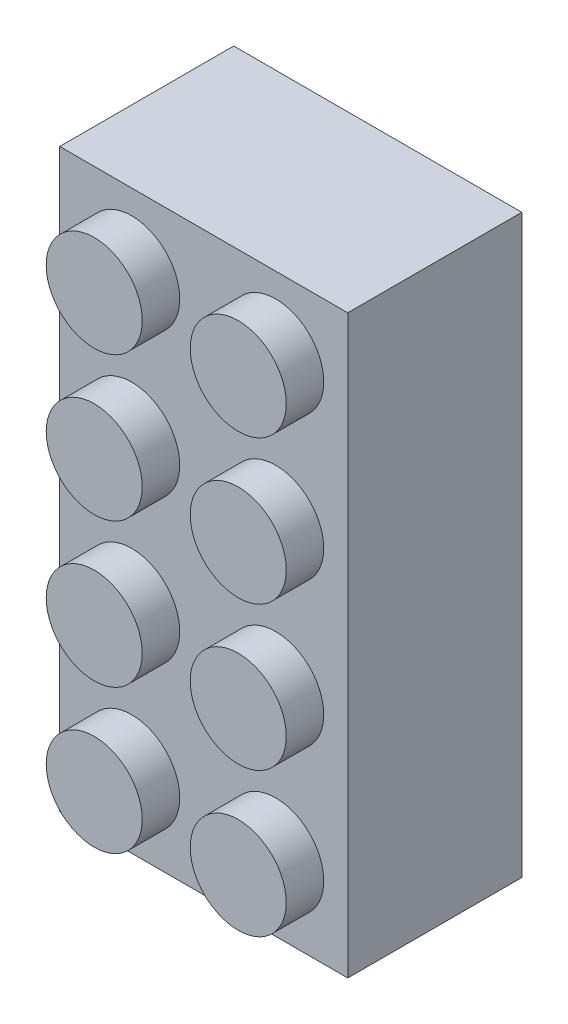
ISO-10303-21;
HEADER;
FILE_DESCRIPTION(('STEP AP214'),'2;1');
FILE_NAME('part.step','',(''),(''),'','','');
FILE_SCHEMA(('AUTOMOTIVE_DESIGN { 1 0 10303 214 1 1 1 1 }'));
ENDSEC;
DATA;
#1=APPLICATION_CONTEXT('core data for automotive mechanical design processes');
#2=APPLICATION_PROTOCOL_DEFINITION('international standard','automotive_design',2000,#1);
#3=PRODUCT_CONTEXT('',#1,'mechanical');
#4=PRODUCT('Part','Part','',(#3));
#5=PRODUCT_RELATED_PRODUCT_CATEGORY('part','',(#4));
#6=PRODUCT_DEFINITION_FORMATION('','',#4);
#7=PRODUCT_DEFINITION_CONTEXT('part definition',#1,'design');
#8=PRODUCT_DEFINITION('design','',#6,#7);
#9=PRODUCT_DEFINITION_SHAPE('','',#8);
#10=(LENGTH_UNIT() NAMED_UNIT(*) SI_UNIT(.MILLI.,.METRE.));
#11=(NAMED_UNIT(*) PLANE_ANGLE_UNIT() SI_UNIT($,.RADIAN.));
#12=(NAMED_UNIT(*) SI_UNIT($,.STERADIAN.) SOLID_ANGLE_UNIT());
#13=UNCERTAINTY_MEASURE_WITH_UNIT(LENGTH_MEASURE(1.E-05),#10,'distance_accuracy_value','');
#14=(GEOMETRIC_REPRESENTATION_CONTEXT(3) GLOBAL_UNCERTAINTY_ASSIGNED_CONTEXT((#13)) GLOBAL_UNIT_ASSIGNED_CONTEXT((#10,
#11,#12)) REPRESENTATION_CONTEXT('',''));
#15=CARTESIAN_POINT('',(0.,0.,0.));
#16=DIRECTION('',(0.,0.,1.));
#17=DIRECTION('',(1.,0.,0.));
#18=AXIS2_PLACEMENT_3D('',#15,#16,#17);
#19=CARTESIAN_POINT('',(48.,144.,0.));
#20=DIRECTION('',(0.,0.,-1.));
#21=DIRECTION('',(-1.,0.,0.));
#22=AXIS2_PLACEMENT_3D('',#19,#20,#21);
#23=PLANE('',#22);
#24=DIRECTION('',(0.,-1.,0.));
#25=VECTOR('',#24,1.);
#26=CARTESIAN_POINT('',(7.99999999999999,104.,0.));
#27=LINE('',#26,#25);
#28=CARTESIAN_POINT('',(7.99999999999999,184.,0.));
#29=VERTEX_POINT('',#28);
#30=CARTESIAN_POINT('',(8.00000000000001,8.00000000000001,0.));
#31=VERTEX_POINT('',#30);
#32=EDGE_CURVE('E59',#29,#31,#27,.T.);
#33=ORIENTED_EDGE('',*,*,#32,.T.);
#34=DIRECTION('',(1.,0.,0.));
#35=VECTOR('',#34,1.);
#36=CARTESIAN_POINT('',(88.,8.00000000000001,0.));
#37=LINE('',#36,#35);
#38=CARTESIAN_POINT('',(88.,8.00000000000001,0.));
#39=VERTEX_POINT('',#38);
#40=EDGE_CURVE('E141',#31,#39,#37,.T.);
#41=ORIENTED_EDGE('',*,*,#40,.T.);
#42=DIRECTION('',(0.,1.,0.));
#43=VECTOR('',#42,1.);
#44=CARTESIAN_POINT('',(88.,184.,0.));
#45=LINE('',#44,#43);
#46=CARTESIAN_POINT('',(88.,184.,0.));
#47=VERTEX_POINT('',#46);
#48=EDGE_CURVE('E235',#39,#47,#45,.T.);
#49=ORIENTED_EDGE('',*,*,#48,.T.);
#50=DIRECTION('',(-1.,0.,0.));
#51=VECTOR('',#50,1.);
#52=CARTESIAN_POINT('',(7.99999999999999,184.,0.));
#53=LINE('',#52,#51);
#54=EDGE_CURVE('E224',#47,#29,#53,.T.);
#55=ORIENTED_EDGE('',*,*,#54,.T.);
#56=EDGE_LOOP('',(#33,#41,#49,#55));
#57=FACE_BOUND('',#56,.T.);
#58=DIRECTION('',(0.,-1.,0.));
#59=VECTOR('',#58,1.);
#60=CARTESIAN_POINT('',(0.,96.,0.));
#61=LINE('',#60,#59);
#62=CARTESIAN_POINT('',(0.,192.,0.));
#63=VERTEX_POINT('',#62);
#64=CARTESIAN_POINT('',(0.,0.,0.));
#65=VERTEX_POINT('',#64);
#66=EDGE_CURVE('E129',#63,#65,#61,.T.);
#67=ORIENTED_EDGE('',*,*,#66,.F.);
#68=DIRECTION('',(-1.,0.,0.));
#69=VECTOR('',#68,1.);
#70=CARTESIAN_POINT('',(0.,192.,0.));
#71=LINE('',#70,#69);
#72=CARTESIAN_POINT('',(96.,192.,0.));
#73=VERTEX_POINT('',#72);
#74=EDGE_CURVE('E67',#73,#63,#71,.T.);
#75=ORIENTED_EDGE('',*,*,#74,.F.);
#76=DIRECTION('',(0.,1.,0.));
#77=VECTOR('',#76,1.);
#78=CARTESIAN_POINT('',(96.,192.,0.));
#79=LINE('',#78,#77);
#80=CARTESIAN_POINT('',(96.,0.,0.));
#81=VERTEX_POINT('',#80);
#82=EDGE_CURVE('E249',#81,#73,#79,.T.);
#83=ORIENTED_EDGE('',*,*,#82,.F.);
#84=DIRECTION('',(1.,0.,0.));
#85=VECTOR('',#84,1.);
#86=CARTESIAN_POINT('',(96.,0.,0.));
#87=LINE('',#86,#85);
#88=EDGE_CURVE('E164',#65,#81,#87,.T.);
#89=ORIENTED_EDGE('',*,*,#88,.F.);
#90=EDGE_LOOP('',(#67,#75,#83,#89));
#91=FACE_BOUND('',#90,.T.);
#92=ADVANCED_FACE('F43',(#57,#91),#23,.T.);
#93=CARTESIAN_POINT('',(0.,96.,48.));
#94=DIRECTION('',(1.,0.,0.));
#95=DIRECTION('',(0.,1.,0.));
#96=AXIS2_PLACEMENT_3D('',#93,#94,#95);
#97=PLANE('',#96);
#98=ORIENTED_EDGE('',*,*,#66,.T.);
#99=DIRECTION('',(0.,0.,-1.));
#100=VECTOR('',#99,1.);
#101=CARTESIAN_POINT('',(0.,0.,48.));
#102=LINE('',#101,#100);
#103=CARTESIAN_POINT('',(0.,0.,58.));
#104=VERTEX_POINT('',#103);
#105=EDGE_CURVE('E126',#104,#65,#102,.T.);
#106=ORIENTED_EDGE('',*,*,#105,.F.);
#107=DIRECTION('',(0.,1.,0.));
#108=VECTOR('',#107,1.);
#109=CARTESIAN_POINT('',(0.,192.,58.));
#110=LINE('',#109,#108);
#111=CARTESIAN_POINT('',(0.,192.,58.));
#112=VERTEX_POINT('',#111);
#113=EDGE_CURVE('E112',#104,#112,#110,.T.);
#114=ORIENTED_EDGE('',*,*,#113,.T.);
#115=DIRECTION('',(0.,0.,-1.));
#116=VECTOR('',#115,1.);
#117=CARTESIAN_POINT('',(0.,192.,48.));
#118=LINE('',#117,#116);
#119=EDGE_CURVE('E254',#112,#63,#118,.T.);
#120=ORIENTED_EDGE('',*,*,#119,.T.);
#121=EDGE_LOOP('',(#98,#106,#114,#120));
#122=FACE_BOUND('',#121,.T.);
#123=ADVANCED_FACE('F127',(#122),#97,.F.);
#124=CARTESIAN_POINT('',(96.,192.,48.));
#125=DIRECTION('',(-1.,0.,0.));
#126=DIRECTION('',(0.,-1.,0.));
#127=AXIS2_PLACEMENT_3D('',#124,#125,#126);
#128=PLANE('',#127);
#129=ORIENTED_EDGE('',*,*,#82,.T.);
#130=DIRECTION('',(0.,0.,-1.));
#131=VECTOR('',#130,1.);
#132=CARTESIAN_POINT('',(96.,192.,48.));
#133=LINE('',#132,#131);
#134=CARTESIAN_POINT('',(96.,192.,58.));
#135=VERTEX_POINT('',#134);
#136=EDGE_CURVE('E257',#135,#73,#133,.T.);
#137=ORIENTED_EDGE('',*,*,#136,.F.);
#138=DIRECTION('',(0.,-1.,0.));
#139=VECTOR('',#138,1.);
#140=CARTESIAN_POINT('',(96.,192.,58.));
#141=LINE('',#140,#139);
#142=CARTESIAN_POINT('',(96.,0.,58.));
#143=VERTEX_POINT('',#142);
#144=EDGE_CURVE('E123',#135,#143,#141,.T.);
#145=ORIENTED_EDGE('',*,*,#144,.T.);
#146=DIRECTION('',(0.,0.,-1.));
#147=VECTOR('',#146,1.);
#148=CARTESIAN_POINT('',(96.,0.,48.));
#149=LINE('',#148,#147);
#150=EDGE_CURVE('E135',#143,#81,#149,.T.);
#151=ORIENTED_EDGE('',*,*,#150,.T.);
#152=EDGE_LOOP('',(#129,#137,#145,#151));
#153=FACE_BOUND('',#152,.T.);
#154=ADVANCED_FACE('F317',(#153),#128,.F.);
#155=CARTESIAN_POINT('',(0.,192.,48.));
#156=DIRECTION('',(0.,-1.,0.));
#157=DIRECTION('',(1.,0.,0.));
#158=AXIS2_PLACEMENT_3D('',#155,#156,#157);
#159=PLANE('',#158);
#160=ORIENTED_EDGE('',*,*,#74,.T.);
#161=ORIENTED_EDGE('',*,*,#119,.F.);
#162=DIRECTION('',(1.,0.,0.));
#163=VECTOR('',#162,1.);
#164=CARTESIAN_POINT('',(0.,192.,58.));
#165=LINE('',#164,#163);
#166=EDGE_CURVE('E120',#112,#135,#165,.T.);
#167=ORIENTED_EDGE('',*,*,#166,.T.);
#168=ORIENTED_EDGE('',*,*,#136,.T.);
#169=EDGE_LOOP('',(#160,#161,#167,#168));
#170=FACE_BOUND('',#169,.T.);
#171=ADVANCED_FACE('F324',(#170),#159,.F.);
#172=CARTESIAN_POINT('',(7.99999999999999,104.,48.));
#173=DIRECTION('',(1.,0.,0.));
#174=DIRECTION('',(0.,0.,-1.));
#175=AXIS2_PLACEMENT_3D('',#172,#173,#174);
#176=PLANE('',#175);
#177=ORIENTED_EDGE('',*,*,#32,.F.);
#178=DIRECTION('',(0.,0.,-1.));
#179=VECTOR('',#178,1.);
#180=CARTESIAN_POINT('',(7.99999999999999,184.,48.));
#181=LINE('',#180,#179);
#182=CARTESIAN_POINT('',(7.99999999999999,184.,48.));
#183=VERTEX_POINT('',#182);
#184=EDGE_CURVE('E232',#183,#29,#181,.T.);
#185=ORIENTED_EDGE('',*,*,#184,.F.);
#186=DIRECTION('',(0.,-1.,0.));
#187=VECTOR('',#186,1.);
#188=CARTESIAN_POINT('',(7.99999999999999,104.,48.));
#189=LINE('',#188,#187);
#190=CARTESIAN_POINT('',(8.00000000000001,8.00000000000001,48.));
#191=VERTEX_POINT('',#190);
#192=EDGE_CURVE('E220',#183,#191,#189,.T.);
#193=ORIENTED_EDGE('',*,*,#192,.T.);
#194=DIRECTION('',(0.,0.,-1.));
#195=VECTOR('',#194,1.);
#196=CARTESIAN_POINT('',(8.00000000000001,8.00000000000001,48.));
#197=LINE('',#196,#195);
#198=EDGE_CURVE('E161',#191,#31,#197,.T.);
#199=ORIENTED_EDGE('',*,*,#198,.T.);
#200=EDGE_LOOP('',(#177,#185,#193,#199));
#201=FACE_BOUND('',#200,.T.);
#202=ADVANCED_FACE('F322',(#201),#176,.T.);
#203=CARTESIAN_POINT('',(88.,184.,48.));
#204=DIRECTION('',(-1.,0.,0.));
#205=DIRECTION('',(0.,0.,1.));
#206=AXIS2_PLACEMENT_3D('',#203,#204,#205);
#207=PLANE('',#206);
#208=ORIENTED_EDGE('',*,*,#48,.F.);
#209=DIRECTION('',(0.,0.,-1.));
#210=VECTOR('',#209,1.);
#211=CARTESIAN_POINT('',(88.,8.00000000000001,48.));
#212=LINE('',#211,#210);
#213=CARTESIAN_POINT('',(88.,8.00000000000001,48.));
#214=VERTEX_POINT('',#213);
#215=EDGE_CURVE('E156',#214,#39,#212,.T.);
#216=ORIENTED_EDGE('',*,*,#215,.F.);
#217=DIRECTION('',(0.,1.,0.));
#218=VECTOR('',#217,1.);
#219=CARTESIAN_POINT('',(88.,184.,48.));
#220=LINE('',#219,#218);
#221=CARTESIAN_POINT('',(88.,184.,48.));
#222=VERTEX_POINT('',#221);
#223=EDGE_CURVE('E223',#214,#222,#220,.T.);
#224=ORIENTED_EDGE('',*,*,#223,.T.);
#225=DIRECTION('',(0.,0.,-1.));
#226=VECTOR('',#225,1.);
#227=CARTESIAN_POINT('',(88.,184.,48.));
#228=LINE('',#227,#226);
#229=EDGE_CURVE('E244',#222,#47,#228,.T.);
#230=ORIENTED_EDGE('',*,*,#229,.T.);
#231=EDGE_LOOP('',(#208,#216,#224,#230));
#232=FACE_BOUND('',#231,.T.);
#233=ADVANCED_FACE('F597',(#232),#207,.T.);
#234=CARTESIAN_POINT('',(7.99999999999999,184.,48.));
#235=DIRECTION('',(0.,-1.,0.));
#236=DIRECTION('',(0.,0.,-1.));
#237=AXIS2_PLACEMENT_3D('',#234,#235,#236);
#238=PLANE('',#237);
#239=ORIENTED_EDGE('',*,*,#54,.F.);
#240=ORIENTED_EDGE('',*,*,#229,.F.);
#241=DIRECTION('',(-1.,0.,0.));
#242=VECTOR('',#241,1.);
#243=CARTESIAN_POINT('',(7.99999999999999,184.,48.));
#244=LINE('',#243,#242);
#245=EDGE_CURVE('E228',#222,#183,#244,.T.);
#246=ORIENTED_EDGE('',*,*,#245,.T.);
#247=ORIENTED_EDGE('',*,*,#184,.T.);
#248=EDGE_LOOP('',(#239,#240,#246,#247));
#249=FACE_BOUND('',#248,.T.);
#250=ADVANCED_FACE('F309',(#249),#238,.T.);
#251=CARTESIAN_POINT('',(48.,144.,48.));
#252=DIRECTION('',(0.,0.,1.));
#253=DIRECTION('',(1.,0.,0.));
#254=AXIS2_PLACEMENT_3D('',#251,#252,#253);
#255=PLANE('',#254);
#256=CARTESIAN_POINT('',(48.,96.,48.));
#257=DIRECTION('',(0.,0.,1.));
#258=DIRECTION('',(1.,0.,0.));
#259=AXIS2_PLACEMENT_3D('',#256,#257,#258);
#260=CIRCLE('',#259,22.6994558492443);
#261=CARTESIAN_POINT('',(70.6994558492443,96.,48.));
#262=VERTEX_POINT('',#261);
#263=EDGE_CURVE('E12',#262,#262,#260,.T.);
#264=ORIENTED_EDGE('',*,*,#263,.T.);
#265=EDGE_LOOP('',(#264));
#266=FACE_BOUND('',#265,.T.);
#267=CARTESIAN_POINT('',(48.,144.,48.));
#268=DIRECTION('',(0.,0.,1.));
#269=DIRECTION('',(1.,0.,0.));
#270=AXIS2_PLACEMENT_3D('',#267,#268,#269);
#271=CIRCLE('',#270,22.6994558492444);
#272=CARTESIAN_POINT('',(70.6994558492443,144.,48.));
#273=VERTEX_POINT('',#272);
#274=EDGE_CURVE('E280',#273,#273,#271,.T.);
#275=ORIENTED_EDGE('',*,*,#274,.T.);
#276=EDGE_LOOP('',(#275));
#277=FACE_BOUND('',#276,.T.);
#278=ORIENTED_EDGE('',*,*,#192,.F.);
#279=ORIENTED_EDGE('',*,*,#245,.F.);
#280=ORIENTED_EDGE('',*,*,#223,.F.);
#281=DIRECTION('',(1.,0.,0.));
#282=VECTOR('',#281,1.);
#283=CARTESIAN_POINT('',(88.,8.00000000000001,48.));
#284=LINE('',#283,#282);
#285=EDGE_CURVE('E147',#191,#214,#284,.T.);
#286=ORIENTED_EDGE('',*,*,#285,.F.);
#287=EDGE_LOOP('',(#278,#279,#280,#286));
#288=FACE_BOUND('',#287,.T.);
#289=CARTESIAN_POINT('',(48.,48.,48.));
#290=DIRECTION('',(0.,0.,1.));
#291=DIRECTION('',(1.,0.,0.));
#292=AXIS2_PLACEMENT_3D('',#289,#290,#291);
#293=CIRCLE('',#292,22.6994558492444);
#294=CARTESIAN_POINT('',(70.6994558492444,48.,48.));
#295=VERTEX_POINT('',#294);
#296=EDGE_CURVE('E188',#295,#295,#293,.T.);
#297=ORIENTED_EDGE('',*,*,#296,.T.);
#298=EDGE_LOOP('',(#297));
#299=FACE_BOUND('',#298,.T.);
#300=ADVANCED_FACE('F294',(#266,#277,#288,#299),#255,.F.);
#301=CARTESIAN_POINT('',(48.,144.,58.));
#302=DIRECTION('',(0.,0.,-1.));
#303=DIRECTION('',(-1.,0.,0.));
#304=AXIS2_PLACEMENT_3D('',#301,#302,#303);
#305=PLANE('',#304);
#306=CARTESIAN_POINT('',(24.,120.,58.));
#307=DIRECTION('',(0.,0.,-1.));
#308=DIRECTION('',(-1.,0.,0.));
#309=AXIS2_PLACEMENT_3D('',#306,#307,#308);
#310=CIRCLE('',#309,16.);
#311=CARTESIAN_POINT('',(7.99999999999997,120.,58.));
#312=VERTEX_POINT('',#311);
#313=EDGE_CURVE('E272',#312,#312,#310,.F.);
#314=ORIENTED_EDGE('',*,*,#313,.F.);
#315=EDGE_LOOP('',(#314));
#316=FACE_BOUND('',#315,.T.);
#317=CARTESIAN_POINT('',(72.,120.,58.));
#318=DIRECTION('',(0.,0.,-1.));
#319=DIRECTION('',(-1.,0.,0.));
#320=AXIS2_PLACEMENT_3D('',#317,#318,#319);
#321=CIRCLE('',#320,16.);
#322=CARTESIAN_POINT('',(56.,120.,58.));
#323=VERTEX_POINT('',#322);
#324=EDGE_CURVE('E268',#323,#323,#321,.F.);
#325=ORIENTED_EDGE('',*,*,#324,.F.);
#326=EDGE_LOOP('',(#325));
#327=FACE_BOUND('',#326,.T.);
#328=CARTESIAN_POINT('',(72.,168.,58.));
#329=DIRECTION('',(0.,0.,-1.));
#330=DIRECTION('',(-1.,0.,0.));
#331=AXIS2_PLACEMENT_3D('',#328,#329,#330);
#332=CIRCLE('',#331,16.);
#333=CARTESIAN_POINT('',(56.,168.,58.));
#334=VERTEX_POINT('',#333);
#335=EDGE_CURVE('E264',#334,#334,#332,.F.);
#336=ORIENTED_EDGE('',*,*,#335,.F.);
#337=EDGE_LOOP('',(#336));
#338=FACE_BOUND('',#337,.T.);
#339=CARTESIAN_POINT('',(24.,168.,58.));
#340=DIRECTION('',(0.,0.,-1.));
#341=DIRECTION('',(-1.,0.,0.));
#342=AXIS2_PLACEMENT_3D('',#339,#340,#341);
#343=CIRCLE('',#342,16.);
#344=CARTESIAN_POINT('',(7.99999999999997,168.,58.));
#345=VERTEX_POINT('',#344);
#346=EDGE_CURVE('E260',#345,#345,#343,.F.);
#347=ORIENTED_EDGE('',*,*,#346,.F.);
#348=EDGE_LOOP('',(#347));
#349=FACE_BOUND('',#348,.T.);
#350=ORIENTED_EDGE('',*,*,#113,.F.);
#351=DIRECTION('',(-1.,0.,0.));
#352=VECTOR('',#351,1.);
#353=CARTESIAN_POINT('',(0.,0.,58.));
#354=LINE('',#353,#352);
#355=EDGE_CURVE('E118',#143,#104,#354,.T.);
#356=ORIENTED_EDGE('',*,*,#355,.F.);
#357=ORIENTED_EDGE('',*,*,#144,.F.);
#358=ORIENTED_EDGE('',*,*,#166,.F.);
#359=EDGE_LOOP('',(#350,#356,#357,#358));
#360=FACE_BOUND('',#359,.T.);
#361=CARTESIAN_POINT('',(24.,24.,58.));
#362=DIRECTION('',(0.,0.,-1.));
#363=DIRECTION('',(-1.,0.,0.));
#364=AXIS2_PLACEMENT_3D('',#361,#362,#363);
#365=CIRCLE('',#364,16.);
#366=CARTESIAN_POINT('',(7.99999999999999,24.,58.));
#367=VERTEX_POINT('',#366);
#368=EDGE_CURVE('E180',#367,#367,#365,.F.);
#369=ORIENTED_EDGE('',*,*,#368,.F.);
#370=EDGE_LOOP('',(#369));
#371=FACE_BOUND('',#370,.T.);
#372=CARTESIAN_POINT('',(72.,24.,58.));
#373=DIRECTION('',(0.,0.,-1.));
#374=DIRECTION('',(-1.,0.,0.));
#375=AXIS2_PLACEMENT_3D('',#372,#373,#374);
#376=CIRCLE('',#375,16.);
#377=CARTESIAN_POINT('',(56.,24.,58.));
#378=VERTEX_POINT('',#377);
#379=EDGE_CURVE('E176',#378,#378,#376,.F.);
#380=ORIENTED_EDGE('',*,*,#379,.F.);
#381=EDGE_LOOP('',(#380));
#382=FACE_BOUND('',#381,.T.);
#383=CARTESIAN_POINT('',(72.,72.,58.));
#384=DIRECTION('',(0.,0.,-1.));
#385=DIRECTION('',(-1.,0.,0.));
#386=AXIS2_PLACEMENT_3D('',#383,#384,#385);
#387=CIRCLE('',#386,16.);
#388=CARTESIAN_POINT('',(56.,72.,58.));
#389=VERTEX_POINT('',#388);
#390=EDGE_CURVE('E172',#389,#389,#387,.F.);
#391=ORIENTED_EDGE('',*,*,#390,.F.);
#392=EDGE_LOOP('',(#391));
#393=FACE_BOUND('',#392,.T.);
#394=CARTESIAN_POINT('',(24.,72.,58.));
#395=DIRECTION('',(0.,0.,-1.));
#396=DIRECTION('',(-1.,0.,0.));
#397=AXIS2_PLACEMENT_3D('',#394,#395,#396);
#398=CIRCLE('',#397,16.);
#399=CARTESIAN_POINT('',(7.99999999999999,72.,58.));
#400=VERTEX_POINT('',#399);
#401=EDGE_CURVE('E134',#400,#400,#398,.F.);
#402=ORIENTED_EDGE('',*,*,#401,.F.);
#403=EDGE_LOOP('',(#402));
#404=FACE_BOUND('',#403,.T.);
#405=ADVANCED_FACE('F114',(#316,#327,#338,#349,#360,#371,#382,#393,#404),#305,.F.);
#406=CARTESIAN_POINT('',(24.,168.,70.5));
#407=DIRECTION('',(0.,0.,-1.));
#408=DIRECTION('',(-1.,0.,0.));
#409=AXIS2_PLACEMENT_3D('',#406,#407,#408);
#410=CYLINDRICAL_SURFACE('',#409,16.);
#411=CARTESIAN_POINT('',(24.,168.,70.5));
#412=DIRECTION('',(0.,0.,1.));
#413=DIRECTION('',(1.,0.,0.));
#414=AXIS2_PLACEMENT_3D('',#411,#412,#413);
#415=CIRCLE('',#414,16.);
#416=CARTESIAN_POINT('',(40.,168.,70.5));
#417=VERTEX_POINT('',#416);
#418=EDGE_CURVE('E212',#417,#417,#415,.T.);
#419=ORIENTED_EDGE('',*,*,#418,.F.);
#420=EDGE_LOOP('',(#419));
#421=FACE_BOUND('',#420,.T.);
#422=ORIENTED_EDGE('',*,*,#346,.T.);
#423=EDGE_LOOP('',(#422));
#424=FACE_BOUND('',#423,.T.);
#425=ADVANCED_FACE('F380',(#421,#424),#410,.T.);
#426=CARTESIAN_POINT('',(24.,168.,70.5));
#427=DIRECTION('',(0.,0.,1.));
#428=DIRECTION('',(1.,0.,0.));
#429=AXIS2_PLACEMENT_3D('',#426,#427,#428);
#430=PLANE('',#429);
#431=ORIENTED_EDGE('',*,*,#418,.T.);
#432=EDGE_LOOP('',(#431));
#433=FACE_BOUND('',#432,.T.);
#434=ADVANCED_FACE('F376',(#433),#430,.T.);
#435=CARTESIAN_POINT('',(72.,168.,70.5));
#436=DIRECTION('',(0.,0.,-1.));
#437=DIRECTION('',(-1.,0.,0.));
#438=AXIS2_PLACEMENT_3D('',#435,#436,#437);
#439=CYLINDRICAL_SURFACE('',#438,16.);
#440=CARTESIAN_POINT('',(72.,168.,70.5));
#441=DIRECTION('',(0.,0.,1.));
#442=DIRECTION('',(1.,0.,0.));
#443=AXIS2_PLACEMENT_3D('',#440,#441,#442);
#444=CIRCLE('',#443,16.);
#445=CARTESIAN_POINT('',(88.,168.,70.5));
#446=VERTEX_POINT('',#445);
#447=EDGE_CURVE('E208',#446,#446,#444,.T.);
#448=ORIENTED_EDGE('',*,*,#447,.F.);
#449=EDGE_LOOP('',(#448));
#450=FACE_BOUND('',#449,.T.);
#451=ORIENTED_EDGE('',*,*,#335,.T.);
#452=EDGE_LOOP('',(#451));
#453=FACE_BOUND('',#452,.T.);
#454=ADVANCED_FACE('F372',(#450,#453),#439,.T.);
#455=CARTESIAN_POINT('',(72.,168.,70.5));
#456=DIRECTION('',(0.,0.,1.));
#457=DIRECTION('',(1.,0.,0.));
#458=AXIS2_PLACEMENT_3D('',#455,#456,#457);
#459=PLANE('',#458);
#460=ORIENTED_EDGE('',*,*,#447,.T.);
#461=EDGE_LOOP('',(#460));
#462=FACE_BOUND('',#461,.T.);
#463=ADVANCED_FACE('F368',(#462),#459,.T.);
#464=CARTESIAN_POINT('',(72.,120.,70.5));
#465=DIRECTION('',(0.,0.,-1.));
#466=DIRECTION('',(-1.,0.,0.));
#467=AXIS2_PLACEMENT_3D('',#464,#465,#466);
#468=CYLINDRICAL_SURFACE('',#467,16.);
#469=CARTESIAN_POINT('',(72.,120.,70.5));
#470=DIRECTION('',(0.,0.,1.));
#471=DIRECTION('',(1.,0.,0.));
#472=AXIS2_PLACEMENT_3D('',#469,#470,#471);
#473=CIRCLE('',#472,16.);
#474=CARTESIAN_POINT('',(88.,120.,70.5));
#475=VERTEX_POINT('',#474);
#476=EDGE_CURVE('E204',#475,#475,#473,.T.);
#477=ORIENTED_EDGE('',*,*,#476,.F.);
#478=EDGE_LOOP('',(#477));
#479=FACE_BOUND('',#478,.T.);
#480=ORIENTED_EDGE('',*,*,#324,.T.);
#481=EDGE_LOOP('',(#480));
#482=FACE_BOUND('',#481,.T.);
#483=ADVANCED_FACE('F364',(#479,#482),#468,.T.);
#484=CARTESIAN_POINT('',(72.,120.,70.5));
#485=DIRECTION('',(0.,0.,1.));
#486=DIRECTION('',(1.,0.,0.));
#487=AXIS2_PLACEMENT_3D('',#484,#485,#486);
#488=PLANE('',#487);
#489=ORIENTED_EDGE('',*,*,#476,.T.);
#490=EDGE_LOOP('',(#489));
#491=FACE_BOUND('',#490,.T.);
#492=ADVANCED_FACE('F360',(#491),#488,.T.);
#493=CARTESIAN_POINT('',(24.,120.,70.5));
#494=DIRECTION('',(0.,0.,-1.));
#495=DIRECTION('',(-1.,0.,0.));
#496=AXIS2_PLACEMENT_3D('',#493,#494,#495);
#497=CYLINDRICAL_SURFACE('',#496,16.);
#498=CARTESIAN_POINT('',(24.,120.,70.5));
#499=DIRECTION('',(0.,0.,1.));
#500=DIRECTION('',(1.,0.,0.));
#501=AXIS2_PLACEMENT_3D('',#498,#499,#500);
#502=CIRCLE('',#501,16.);
#503=CARTESIAN_POINT('',(40.,120.,70.5));
#504=VERTEX_POINT('',#503);
#505=EDGE_CURVE('E197',#504,#504,#502,.T.);
#506=ORIENTED_EDGE('',*,*,#505,.F.);
#507=EDGE_LOOP('',(#506));
#508=FACE_BOUND('',#507,.T.);
#509=ORIENTED_EDGE('',*,*,#313,.T.);
#510=EDGE_LOOP('',(#509));
#511=FACE_BOUND('',#510,.T.);
#512=ADVANCED_FACE('F356',(#508,#511),#497,.T.);
#513=CARTESIAN_POINT('',(24.,120.,70.5));
#514=DIRECTION('',(0.,0.,1.));
#515=DIRECTION('',(1.,0.,0.));
#516=AXIS2_PLACEMENT_3D('',#513,#514,#515);
#517=PLANE('',#516);
#518=ORIENTED_EDGE('',*,*,#505,.T.);
#519=EDGE_LOOP('',(#518));
#520=FACE_BOUND('',#519,.T.);
#521=ADVANCED_FACE('F347',(#520),#517,.T.);
#522=CARTESIAN_POINT('',(48.,144.,100.325901807805));
#523=DIRECTION('',(0.,0.,-1.));
#524=DIRECTION('',(-1.,0.,0.));
#525=AXIS2_PLACEMENT_3D('',#522,#523,#524);
#526=CYLINDRICAL_SURFACE('',#525,11.5);
#527=CARTESIAN_POINT('',(48.,144.,0.));
#528=DIRECTION('',(0.,0.,-1.));
#529=DIRECTION('',(-1.,0.,0.));
#530=AXIS2_PLACEMENT_3D('',#527,#528,#529);
#531=CIRCLE('',#530,11.5);
#532=CARTESIAN_POINT('',(36.5,144.,0.));
#533=VERTEX_POINT('',#532);
#534=EDGE_CURVE('E192',#533,#533,#531,.T.);
#535=ORIENTED_EDGE('',*,*,#534,.T.);
#536=EDGE_LOOP('',(#535));
#537=FACE_BOUND('',#536,.T.);
#538=CARTESIAN_POINT('',(48.,144.,48.));
#539=DIRECTION('',(0.,0.,1.));
#540=DIRECTION('',(1.,0.,0.));
#541=AXIS2_PLACEMENT_3D('',#538,#539,#540);
#542=CIRCLE('',#541,11.5);
#543=CARTESIAN_POINT('',(59.5,144.,48.));
#544=VERTEX_POINT('',#543);
#545=EDGE_CURVE('E276',#544,#544,#542,.T.);
#546=ORIENTED_EDGE('',*,*,#545,.T.);
#547=EDGE_LOOP('',(#546));
#548=FACE_BOUND('',#547,.T.);
#549=ADVANCED_FACE('F341',(#537,#548),#526,.F.);
#550=CARTESIAN_POINT('',(48.,144.,0.));
#551=DIRECTION('',(0.,0.,-1.));
#552=DIRECTION('',(-1.,0.,0.));
#553=AXIS2_PLACEMENT_3D('',#550,#551,#552);
#554=PLANE('',#553);
#555=ORIENTED_EDGE('',*,*,#534,.F.);
#556=EDGE_LOOP('',(#555));
#557=FACE_BOUND('',#556,.T.);
#558=CARTESIAN_POINT('',(48.,144.,0.));
#559=DIRECTION('',(0.,0.,-1.));
#560=DIRECTION('',(-1.,0.,0.));
#561=AXIS2_PLACEMENT_3D('',#558,#559,#560);
#562=CIRCLE('',#561,18.5);
#563=CARTESIAN_POINT('',(29.5,144.,0.));
#564=VERTEX_POINT('',#563);
#565=EDGE_CURVE('E193',#564,#564,#562,.T.);
#566=ORIENTED_EDGE('',*,*,#565,.T.);
#567=EDGE_LOOP('',(#566));
#568=FACE_BOUND('',#567,.T.);
#569=ADVANCED_FACE('F306',(#557,#568),#554,.T.);
#570=ORIENTED_EDGE('',*,*,#545,.F.);
#571=EDGE_LOOP('',(#570));
#572=FACE_BOUND('',#571,.T.);
#573=ADVANCED_FACE('F293',(#572),#255,.F.);
#574=CARTESIAN_POINT('',(48.,144.,1.74166236988071E-12));
#575=DIRECTION('',(0.,0.,1.));
#576=DIRECTION('',(1.,0.,0.));
#577=AXIS2_PLACEMENT_3D('',#574,#575,#576);
#578=CONICAL_SURFACE('',#577,18.5,0.0872664625997202);
#579=ORIENTED_EDGE('',*,*,#274,.F.);
#580=EDGE_LOOP('',(#579));
#581=FACE_BOUND('',#580,.T.);
#582=ORIENTED_EDGE('',*,*,#565,.F.);
#583=EDGE_LOOP('',(#582));
#584=FACE_BOUND('',#583,.T.);
#585=ADVANCED_FACE('F305',(#581,#584),#578,.T.);
#586=CARTESIAN_POINT('',(96.,0.,48.));
#587=DIRECTION('',(0.,1.,0.));
#588=DIRECTION('',(-1.,0.,0.));
#589=AXIS2_PLACEMENT_3D('',#586,#587,#588);
#590=PLANE('',#589);
#591=ORIENTED_EDGE('',*,*,#88,.T.);
#592=ORIENTED_EDGE('',*,*,#150,.F.);
#593=ORIENTED_EDGE('',*,*,#355,.T.);
#594=ORIENTED_EDGE('',*,*,#105,.T.);
#595=EDGE_LOOP('',(#591,#592,#593,#594));
#596=FACE_BOUND('',#595,.T.);
#597=ADVANCED_FACE('F138',(#596),#590,.F.);
#598=CARTESIAN_POINT('',(88.,8.00000000000001,48.));
#599=DIRECTION('',(0.,1.,0.));
#600=DIRECTION('',(0.,0.,1.));
#601=AXIS2_PLACEMENT_3D('',#598,#599,#600);
#602=PLANE('',#601);
#603=ORIENTED_EDGE('',*,*,#40,.F.);
#604=ORIENTED_EDGE('',*,*,#198,.F.);
#605=ORIENTED_EDGE('',*,*,#285,.T.);
#606=ORIENTED_EDGE('',*,*,#215,.T.);
#607=EDGE_LOOP('',(#603,#604,#605,#606));
#608=FACE_BOUND('',#607,.T.);
#609=ADVANCED_FACE('F334',(#608),#602,.T.);
#610=CARTESIAN_POINT('',(24.,72.,70.5));
#611=DIRECTION('',(0.,0.,-1.));
#612=DIRECTION('',(-1.,0.,0.));
#613=AXIS2_PLACEMENT_3D('',#610,#611,#612);
#614=CYLINDRICAL_SURFACE('',#613,16.);
#615=CARTESIAN_POINT('',(24.,72.,70.5));
#616=DIRECTION('',(0.,0.,1.));
#617=DIRECTION('',(1.,0.,0.));
#618=AXIS2_PLACEMENT_3D('',#615,#616,#617);
#619=CIRCLE('',#618,16.);
#620=CARTESIAN_POINT('',(40.,72.,70.5));
#621=VERTEX_POINT('',#620);
#622=EDGE_CURVE('E142',#621,#621,#619,.T.);
#623=ORIENTED_EDGE('',*,*,#622,.F.);
#624=EDGE_LOOP('',(#623));
#625=FACE_BOUND('',#624,.T.);
#626=ORIENTED_EDGE('',*,*,#401,.T.);
#627=EDGE_LOOP('',(#626));
#628=FACE_BOUND('',#627,.T.);
#629=ADVANCED_FACE('F453',(#625,#628),#614,.T.);
#630=CARTESIAN_POINT('',(24.,72.,70.5));
#631=DIRECTION('',(0.,0.,1.));
#632=DIRECTION('',(1.,0.,0.));
#633=AXIS2_PLACEMENT_3D('',#630,#631,#632);
#634=PLANE('',#633);
#635=ORIENTED_EDGE('',*,*,#622,.T.);
#636=EDGE_LOOP('',(#635));
#637=FACE_BOUND('',#636,.T.);
#638=ADVANCED_FACE('F462',(#637),#634,.T.);
#639=CARTESIAN_POINT('',(72.,72.,70.5));
#640=DIRECTION('',(0.,0.,-1.));
#641=DIRECTION('',(-1.,0.,0.));
#642=AXIS2_PLACEMENT_3D('',#639,#640,#641);
#643=CYLINDRICAL_SURFACE('',#642,16.);
#644=CARTESIAN_POINT('',(72.,72.,70.5));
#645=DIRECTION('',(0.,0.,1.));
#646=DIRECTION('',(1.,0.,0.));
#647=AXIS2_PLACEMENT_3D('',#644,#645,#646);
#648=CIRCLE('',#647,16.);
#649=CARTESIAN_POINT('',(88.,72.,70.5));
#650=VERTEX_POINT('',#649);
#651=EDGE_CURVE('E150',#650,#650,#648,.T.);
#652=ORIENTED_EDGE('',*,*,#651,.F.);
#653=EDGE_LOOP('',(#652));
#654=FACE_BOUND('',#653,.T.);
#655=ORIENTED_EDGE('',*,*,#390,.T.);
#656=EDGE_LOOP('',(#655));
#657=FACE_BOUND('',#656,.T.);
#658=ADVANCED_FACE('F471',(#654,#657),#643,.T.);
#659=CARTESIAN_POINT('',(72.,72.,70.5));
#660=DIRECTION('',(0.,0.,1.));
#661=DIRECTION('',(1.,0.,0.));
#662=AXIS2_PLACEMENT_3D('',#659,#660,#661);
#663=PLANE('',#662);
#664=ORIENTED_EDGE('',*,*,#651,.T.);
#665=EDGE_LOOP('',(#664));
#666=FACE_BOUND('',#665,.T.);
#667=ADVANCED_FACE('F480',(#666),#663,.T.);
#668=CARTESIAN_POINT('',(72.,24.,70.5));
#669=DIRECTION('',(0.,0.,-1.));
#670=DIRECTION('',(-1.,0.,0.));
#671=AXIS2_PLACEMENT_3D('',#668,#669,#670);
#672=CYLINDRICAL_SURFACE('',#671,16.);
#673=CARTESIAN_POINT('',(72.,24.,70.5));
#674=DIRECTION('',(0.,0.,1.));
#675=DIRECTION('',(1.,0.,0.));
#676=AXIS2_PLACEMENT_3D('',#673,#674,#675);
#677=CIRCLE('',#676,16.);
#678=CARTESIAN_POINT('',(88.,24.,70.5));
#679=VERTEX_POINT('',#678);
#680=EDGE_CURVE('E787',#679,#679,#677,.T.);
#681=ORIENTED_EDGE('',*,*,#680,.F.);
#682=EDGE_LOOP('',(#681));
#683=FACE_BOUND('',#682,.T.);
#684=ORIENTED_EDGE('',*,*,#379,.T.);
#685=EDGE_LOOP('',(#684));
#686=FACE_BOUND('',#685,.T.);
#687=ADVANCED_FACE('F489',(#683,#686),#672,.T.);
#688=CARTESIAN_POINT('',(72.,24.,70.5));
#689=DIRECTION('',(0.,0.,1.));
#690=DIRECTION('',(1.,0.,0.));
#691=AXIS2_PLACEMENT_3D('',#688,#689,#690);
#692=PLANE('',#691);
#693=ORIENTED_EDGE('',*,*,#680,.T.);
#694=EDGE_LOOP('',(#693));
#695=FACE_BOUND('',#694,.T.);
#696=ADVANCED_FACE('F498',(#695),#692,.T.);
#697=CARTESIAN_POINT('',(24.,24.,70.5));
#698=DIRECTION('',(0.,0.,-1.));
#699=DIRECTION('',(-1.,0.,0.));
#700=AXIS2_PLACEMENT_3D('',#697,#698,#699);
#701=CYLINDRICAL_SURFACE('',#700,16.);
#702=CARTESIAN_POINT('',(24.,24.,70.5));
#703=DIRECTION('',(0.,0.,1.));
#704=DIRECTION('',(1.,0.,0.));
#705=AXIS2_PLACEMENT_3D('',#702,#703,#704);
#706=CIRCLE('',#705,16.);
#707=CARTESIAN_POINT('',(40.,24.,70.5));
#708=VERTEX_POINT('',#707);
#709=EDGE_CURVE('E781',#708,#708,#706,.T.);
#710=ORIENTED_EDGE('',*,*,#709,.F.);
#711=EDGE_LOOP('',(#710));
#712=FACE_BOUND('',#711,.T.);
#713=ORIENTED_EDGE('',*,*,#368,.T.);
#714=EDGE_LOOP('',(#713));
#715=FACE_BOUND('',#714,.T.);
#716=ADVANCED_FACE('F507',(#712,#715),#701,.T.);
#717=CARTESIAN_POINT('',(24.,24.,70.5));
#718=DIRECTION('',(0.,0.,1.));
#719=DIRECTION('',(1.,0.,0.));
#720=AXIS2_PLACEMENT_3D('',#717,#718,#719);
#721=PLANE('',#720);
#722=ORIENTED_EDGE('',*,*,#709,.T.);
#723=EDGE_LOOP('',(#722));
#724=FACE_BOUND('',#723,.T.);
#725=ADVANCED_FACE('F516',(#724),#721,.T.);
#726=CARTESIAN_POINT('',(48.,48.,100.325901807805));
#727=DIRECTION('',(0.,0.,-1.));
#728=DIRECTION('',(-1.,0.,0.));
#729=AXIS2_PLACEMENT_3D('',#726,#727,#728);
#730=CYLINDRICAL_SURFACE('',#729,11.5);
#731=CARTESIAN_POINT('',(48.,48.,0.));
#732=DIRECTION('',(0.,0.,-1.));
#733=DIRECTION('',(-1.,0.,0.));
#734=AXIS2_PLACEMENT_3D('',#731,#732,#733);
#735=CIRCLE('',#734,11.5);
#736=CARTESIAN_POINT('',(36.5,48.,0.));
#737=VERTEX_POINT('',#736);
#738=EDGE_CURVE('E782',#737,#737,#735,.T.);
#739=ORIENTED_EDGE('',*,*,#738,.T.);
#740=EDGE_LOOP('',(#739));
#741=FACE_BOUND('',#740,.T.);
#742=CARTESIAN_POINT('',(48.,48.,48.));
#743=DIRECTION('',(0.,0.,1.));
#744=DIRECTION('',(1.,0.,0.));
#745=AXIS2_PLACEMENT_3D('',#742,#743,#744);
#746=CIRCLE('',#745,11.5);
#747=CARTESIAN_POINT('',(59.5,48.,48.));
#748=VERTEX_POINT('',#747);
#749=EDGE_CURVE('E184',#748,#748,#746,.T.);
#750=ORIENTED_EDGE('',*,*,#749,.T.);
#751=EDGE_LOOP('',(#750));
#752=FACE_BOUND('',#751,.T.);
#753=ADVANCED_FACE('F525',(#741,#752),#730,.F.);
#754=CARTESIAN_POINT('',(48.,48.,0.));
#755=DIRECTION('',(0.,0.,-1.));
#756=DIRECTION('',(-1.,0.,0.));
#757=AXIS2_PLACEMENT_3D('',#754,#755,#756);
#758=PLANE('',#757);
#759=ORIENTED_EDGE('',*,*,#738,.F.);
#760=EDGE_LOOP('',(#759));
#761=FACE_BOUND('',#760,.T.);
#762=CARTESIAN_POINT('',(48.,48.,0.));
#763=DIRECTION('',(0.,0.,-1.));
#764=DIRECTION('',(-1.,0.,0.));
#765=AXIS2_PLACEMENT_3D('',#762,#763,#764);
#766=CIRCLE('',#765,18.5);
#767=CARTESIAN_POINT('',(29.5,48.,0.));
#768=VERTEX_POINT('',#767);
#769=EDGE_CURVE('E778',#768,#768,#766,.T.);
#770=ORIENTED_EDGE('',*,*,#769,.T.);
#771=EDGE_LOOP('',(#770));
#772=FACE_BOUND('',#771,.T.);
#773=ADVANCED_FACE('F534',(#761,#772),#758,.T.);
#774=CARTESIAN_POINT('',(48.,48.,48.));
#775=DIRECTION('',(0.,0.,1.));
#776=DIRECTION('',(1.,0.,0.));
#777=AXIS2_PLACEMENT_3D('',#774,#775,#776);
#778=PLANE('',#777);
#779=ORIENTED_EDGE('',*,*,#749,.F.);
#780=EDGE_LOOP('',(#779));
#781=FACE_BOUND('',#780,.T.);
#782=ADVANCED_FACE('F543',(#781),#778,.F.);
#783=CARTESIAN_POINT('',(48.,48.,1.73188282007561E-12));
#784=DIRECTION('',(0.,0.,1.));
#785=DIRECTION('',(1.,0.,0.));
#786=AXIS2_PLACEMENT_3D('',#783,#784,#785);
#787=CONICAL_SURFACE('',#786,18.5,0.0872664625997202);
#788=ORIENTED_EDGE('',*,*,#296,.F.);
#789=EDGE_LOOP('',(#788));
#790=FACE_BOUND('',#789,.T.);
#791=ORIENTED_EDGE('',*,*,#769,.F.);
#792=EDGE_LOOP('',(#791));
#793=FACE_BOUND('',#792,.T.);
#794=ADVANCED_FACE('F352',(#790,#793),#787,.T.);
#795=CARTESIAN_POINT('',(48.,96.,100.325901807805));
#796=DIRECTION('',(0.,0.,-1.));
#797=DIRECTION('',(-1.,0.,0.));
#798=AXIS2_PLACEMENT_3D('',#795,#796,#797);
#799=CYLINDRICAL_SURFACE('',#798,11.5);
#800=CARTESIAN_POINT('',(48.,96.,0.));
#801=DIRECTION('',(0.,0.,-1.));
#802=DIRECTION('',(-1.,0.,0.));
#803=AXIS2_PLACEMENT_3D('',#800,#801,#802);
#804=CIRCLE('',#803,11.5);
#805=CARTESIAN_POINT('',(36.5,96.,0.));
#806=VERTEX_POINT('',#805);
#807=EDGE_CURVE('E793',#806,#806,#804,.T.);
#808=ORIENTED_EDGE('',*,*,#807,.T.);
#809=EDGE_LOOP('',(#808));
#810=FACE_BOUND('',#809,.T.);
#811=CARTESIAN_POINT('',(48.,96.,48.));
#812=DIRECTION('',(0.,0.,1.));
#813=DIRECTION('',(1.,0.,0.));
#814=AXIS2_PLACEMENT_3D('',#811,#812,#813);
#815=CIRCLE('',#814,11.5);
#816=CARTESIAN_POINT('',(59.5,96.,48.));
#817=VERTEX_POINT('',#816);
#818=EDGE_CURVE('E52',#817,#817,#815,.T.);
#819=ORIENTED_EDGE('',*,*,#818,.T.);
#820=EDGE_LOOP('',(#819));
#821=FACE_BOUND('',#820,.T.);
#822=ADVANCED_FACE('F287',(#810,#821),#799,.F.);
#823=CARTESIAN_POINT('',(48.,96.,0.));
#824=DIRECTION('',(0.,0.,-1.));
#825=DIRECTION('',(-1.,0.,0.));
#826=AXIS2_PLACEMENT_3D('',#823,#824,#825);
#827=PLANE('',#826);
#828=ORIENTED_EDGE('',*,*,#807,.F.);
#829=EDGE_LOOP('',(#828));
#830=FACE_BOUND('',#829,.T.);
#831=CARTESIAN_POINT('',(48.,96.,0.));
#832=DIRECTION('',(0.,0.,-1.));
#833=DIRECTION('',(-1.,0.,0.));
#834=AXIS2_PLACEMENT_3D('',#831,#832,#833);
#835=CIRCLE('',#834,18.5);
#836=CARTESIAN_POINT('',(29.5,96.,0.));
#837=VERTEX_POINT('',#836);
#838=EDGE_CURVE('E790',#837,#837,#835,.T.);
#839=ORIENTED_EDGE('',*,*,#838,.T.);
#840=EDGE_LOOP('',(#839));
#841=FACE_BOUND('',#840,.T.);
#842=ADVANCED_FACE('F291',(#830,#841),#827,.T.);
#843=ORIENTED_EDGE('',*,*,#818,.F.);
#844=EDGE_LOOP('',(#843));
#845=FACE_BOUND('',#844,.T.);
#846=ADVANCED_FACE('F289',(#845),#255,.F.);
#847=CARTESIAN_POINT('',(48.,96.,2.78943534937071E-12));
#848=DIRECTION('',(0.,0.,1.));
#849=DIRECTION('',(1.,0.,0.));
#850=AXIS2_PLACEMENT_3D('',#847,#848,#849);
#851=CONICAL_SURFACE('',#850,18.5,0.0872664625997202);
#852=ORIENTED_EDGE('',*,*,#263,.F.);
#853=EDGE_LOOP('',(#852));
#854=FACE_BOUND('',#853,.T.);
#855=ORIENTED_EDGE('',*,*,#838,.F.);
#856=EDGE_LOOP('',(#855));
#857=FACE_BOUND('',#856,.T.);
#858=ADVANCED_FACE('F45',(#854,#857),#851,.T.);
#859=CLOSED_SHELL('',(#92,#123,#154,#171,#202,#233,#250,#300,#405,#425,#434,#454,#463,#483,#492,
#512,#521,#549,#569,#573,#585,#597,#609,#629,#638,#658,#667,#687,#696,#716,#725,#753,#773,#782,
#794,#822,#842,#846,#858));
#860=MANIFOLD_SOLID_BREP('B2',#859);
#861=ADVANCED_BREP_SHAPE_REPRESENTATION('',(#18,#860),#14);
#862=SHAPE_DEFINITION_REPRESENTATION(#9,#861);
ENDSEC;
END-ISO-10303-21;
